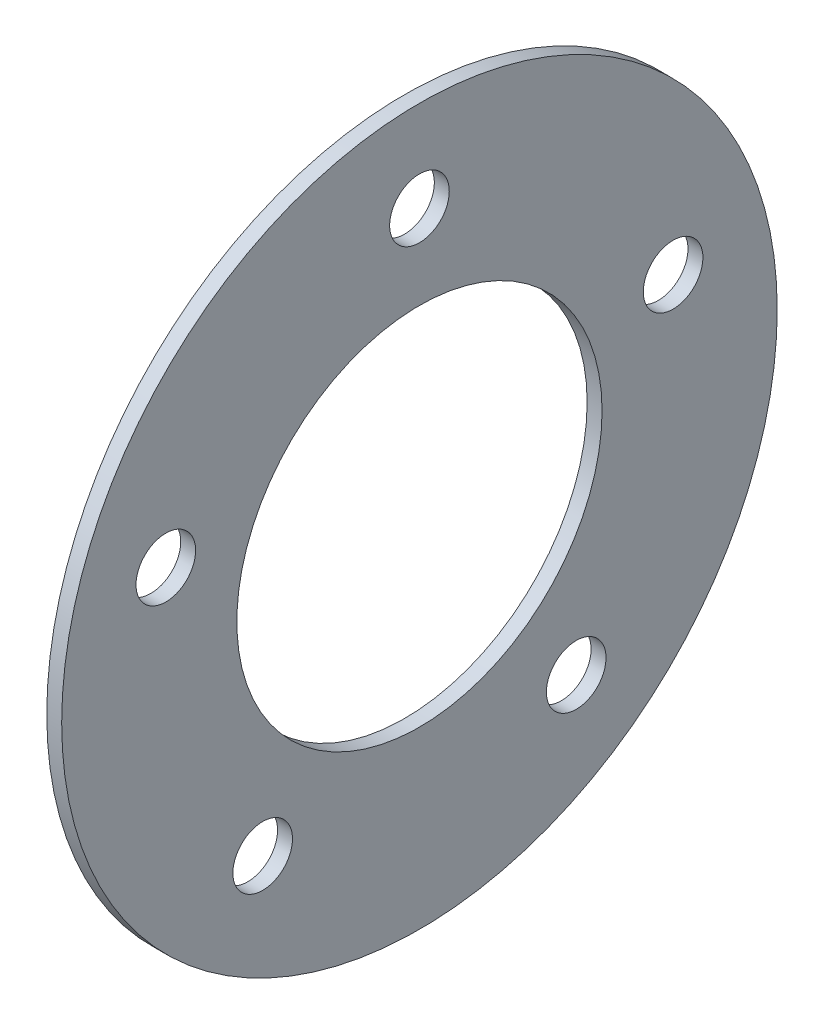
ISO-10303-21;
HEADER;
FILE_DESCRIPTION(('STEP AP214'),'2;1');
FILE_NAME('part.step','',(''),(''),'','','');
FILE_SCHEMA(('AUTOMOTIVE_DESIGN { 1 0 10303 214 1 1 1 1 }'));
ENDSEC;
DATA;
#1=APPLICATION_CONTEXT('core data for automotive mechanical design processes');
#2=APPLICATION_PROTOCOL_DEFINITION('international standard','automotive_design',2000,#1);
#3=PRODUCT_CONTEXT('',#1,'mechanical');
#4=PRODUCT('Part','Part','',(#3));
#5=PRODUCT_RELATED_PRODUCT_CATEGORY('part','',(#4));
#6=PRODUCT_DEFINITION_FORMATION('','',#4);
#7=PRODUCT_DEFINITION_CONTEXT('part definition',#1,'design');
#8=PRODUCT_DEFINITION('design','',#6,#7);
#9=PRODUCT_DEFINITION_SHAPE('','',#8);
#10=(LENGTH_UNIT() NAMED_UNIT(*) SI_UNIT(.MILLI.,.METRE.));
#11=(NAMED_UNIT(*) PLANE_ANGLE_UNIT() SI_UNIT($,.RADIAN.));
#12=(NAMED_UNIT(*) SI_UNIT($,.STERADIAN.) SOLID_ANGLE_UNIT());
#13=UNCERTAINTY_MEASURE_WITH_UNIT(LENGTH_MEASURE(1.E-05),#10,'distance_accuracy_value','');
#14=(GEOMETRIC_REPRESENTATION_CONTEXT(3) GLOBAL_UNCERTAINTY_ASSIGNED_CONTEXT((#13)) GLOBAL_UNIT_ASSIGNED_CONTEXT((#10,
#11,#12)) REPRESENTATION_CONTEXT('',''));
#15=CARTESIAN_POINT('',(0.,0.,0.));
#16=DIRECTION('',(0.,0.,1.));
#17=DIRECTION('',(1.,0.,0.));
#18=AXIS2_PLACEMENT_3D('',#15,#16,#17);
#19=CARTESIAN_POINT('',(1.5875,0.,0.));
#20=DIRECTION('',(1.,0.,0.));
#21=DIRECTION('',(0.,0.,-1.));
#22=AXIS2_PLACEMENT_3D('',#19,#20,#21);
#23=PLANE('',#22);
#24=CARTESIAN_POINT('',(1.5875,17.5520045916606,-54.0195155761761));
#25=DIRECTION('',(1.,0.,0.));
#26=DIRECTION('',(0.,-0.95105651629515,-0.309016994374958));
#27=AXIS2_PLACEMENT_3D('',#24,#25,#26);
#28=CIRCLE('',#27,6.35);
#29=CARTESIAN_POINT('',(1.5875,11.5127957131864,-55.981773490457));
#30=VERTEX_POINT('',#29);
#31=EDGE_CURVE('E88',#30,#30,#28,.T.);
#32=ORIENTED_EDGE('',*,*,#31,.F.);
#33=EDGE_LOOP('',(#32));
#34=FACE_BOUND('',#33,.T.);
#35=CARTESIAN_POINT('',(1.5875,-45.9517445916596,-33.3858966818817));
#36=DIRECTION('',(1.,0.,0.));
#37=DIRECTION('',(0.,-0.58778525229248,0.809016994374942));
#38=AXIS2_PLACEMENT_3D('',#35,#36,#37);
#39=CIRCLE('',#38,6.35);
#40=CARTESIAN_POINT('',(1.5875,-49.6841809437169,-28.2486387676008));
#41=VERTEX_POINT('',#40);
#42=EDGE_CURVE('E82',#41,#41,#39,.T.);
#43=ORIENTED_EDGE('',*,*,#42,.F.);
#44=EDGE_LOOP('',(#43));
#45=FACE_BOUND('',#44,.T.);
#46=CARTESIAN_POINT('',(1.5875,-45.9517445916601,33.385896681881));
#47=DIRECTION('',(1.,0.,0.));
#48=DIRECTION('',(0.,0.587785252292469,0.809016994374951));
#49=AXIS2_PLACEMENT_3D('',#46,#47,#48);
#50=CIRCLE('',#49,6.35);
#51=CARTESIAN_POINT('',(1.5875,-42.219308239603,38.523154596162));
#52=VERTEX_POINT('',#51);
#53=EDGE_CURVE('E75',#52,#52,#50,.T.);
#54=ORIENTED_EDGE('',*,*,#53,.F.);
#55=EDGE_LOOP('',(#54));
#56=FACE_BOUND('',#55,.T.);
#57=CARTESIAN_POINT('',(1.5875,17.5520045916598,54.0195155761763));
#58=DIRECTION('',(1.,0.,0.));
#59=DIRECTION('',(0.,0.951056516295155,-0.309016994374945));
#60=AXIS2_PLACEMENT_3D('',#57,#58,#59);
#61=CIRCLE('',#60,6.35);
#62=CARTESIAN_POINT('',(1.5875,23.591213470134,52.0572576618954));
#63=VERTEX_POINT('',#62);
#64=EDGE_CURVE('E67',#63,#63,#61,.T.);
#65=ORIENTED_EDGE('',*,*,#64,.F.);
#66=EDGE_LOOP('',(#65));
#67=FACE_BOUND('',#66,.T.);
#68=CARTESIAN_POINT('',(1.5875,56.79948,0.));
#69=DIRECTION('',(1.,0.,0.));
#70=DIRECTION('',(0.,0.,-1.));
#71=AXIS2_PLACEMENT_3D('',#68,#69,#70);
#72=CIRCLE('',#71,6.35);
#73=CARTESIAN_POINT('',(1.5875,56.79948,-6.35));
#74=VERTEX_POINT('',#73);
#75=EDGE_CURVE('E60',#74,#74,#72,.T.);
#76=ORIENTED_EDGE('',*,*,#75,.F.);
#77=EDGE_LOOP('',(#76));
#78=FACE_BOUND('',#77,.T.);
#79=CARTESIAN_POINT('',(1.5875,0.,0.));
#80=DIRECTION('',(1.,0.,0.));
#81=DIRECTION('',(0.,0.,-1.));
#82=AXIS2_PLACEMENT_3D('',#79,#80,#81);
#83=CIRCLE('',#82,76.2);
#84=CARTESIAN_POINT('',(1.5875,0.,-76.2));
#85=VERTEX_POINT('',#84);
#86=EDGE_CURVE('E10',#85,#85,#83,.T.);
#87=ORIENTED_EDGE('',*,*,#86,.T.);
#88=EDGE_LOOP('',(#87));
#89=FACE_BOUND('',#88,.T.);
#90=CARTESIAN_POINT('',(1.5875,0.,0.));
#91=DIRECTION('',(1.,0.,0.));
#92=DIRECTION('',(0.,0.,-1.));
#93=AXIS2_PLACEMENT_3D('',#90,#91,#92);
#94=CIRCLE('',#93,38.89375);
#95=CARTESIAN_POINT('',(1.5875,0.,-38.89375));
#96=VERTEX_POINT('',#95);
#97=EDGE_CURVE('E50',#96,#96,#94,.T.);
#98=ORIENTED_EDGE('',*,*,#97,.F.);
#99=EDGE_LOOP('',(#98));
#100=FACE_BOUND('',#99,.T.);
#101=ADVANCED_FACE('F36',(#34,#45,#56,#67,#78,#89,#100),#23,.T.);
#102=CARTESIAN_POINT('',(-1.5875,0.,0.));
#103=DIRECTION('',(1.,0.,0.));
#104=DIRECTION('',(0.,0.,-1.));
#105=AXIS2_PLACEMENT_3D('',#102,#103,#104);
#106=PLANE('',#105);
#107=CARTESIAN_POINT('',(-1.5875,17.5520045916606,-54.0195155761761));
#108=DIRECTION('',(1.,0.,0.));
#109=DIRECTION('',(0.,-0.95105651629515,-0.309016994374958));
#110=AXIS2_PLACEMENT_3D('',#107,#108,#109);
#111=CIRCLE('',#110,6.35);
#112=CARTESIAN_POINT('',(-1.5875,11.5127957131864,-55.981773490457));
#113=VERTEX_POINT('',#112);
#114=EDGE_CURVE('E85',#113,#113,#111,.T.);
#115=ORIENTED_EDGE('',*,*,#114,.T.);
#116=EDGE_LOOP('',(#115));
#117=FACE_BOUND('',#116,.T.);
#118=CARTESIAN_POINT('',(-1.5875,-45.9517445916596,-33.3858966818817));
#119=DIRECTION('',(1.,0.,0.));
#120=DIRECTION('',(0.,-0.58778525229248,0.809016994374942));
#121=AXIS2_PLACEMENT_3D('',#118,#119,#120);
#122=CIRCLE('',#121,6.35);
#123=CARTESIAN_POINT('',(-1.5875,-49.6841809437169,-28.2486387676008));
#124=VERTEX_POINT('',#123);
#125=EDGE_CURVE('E78',#124,#124,#122,.T.);
#126=ORIENTED_EDGE('',*,*,#125,.T.);
#127=EDGE_LOOP('',(#126));
#128=FACE_BOUND('',#127,.T.);
#129=CARTESIAN_POINT('',(-1.5875,-45.9517445916601,33.385896681881));
#130=DIRECTION('',(1.,0.,0.));
#131=DIRECTION('',(0.,0.587785252292469,0.809016994374951));
#132=AXIS2_PLACEMENT_3D('',#129,#130,#131);
#133=CIRCLE('',#132,6.35);
#134=CARTESIAN_POINT('',(-1.5875,-42.219308239603,38.523154596162));
#135=VERTEX_POINT('',#134);
#136=EDGE_CURVE('E71',#135,#135,#133,.T.);
#137=ORIENTED_EDGE('',*,*,#136,.T.);
#138=EDGE_LOOP('',(#137));
#139=FACE_BOUND('',#138,.T.);
#140=CARTESIAN_POINT('',(-1.5875,17.5520045916598,54.0195155761763));
#141=DIRECTION('',(1.,0.,0.));
#142=DIRECTION('',(0.,0.951056516295155,-0.309016994374945));
#143=AXIS2_PLACEMENT_3D('',#140,#141,#142);
#144=CIRCLE('',#143,6.35);
#145=CARTESIAN_POINT('',(-1.5875,23.591213470134,52.0572576618954));
#146=VERTEX_POINT('',#145);
#147=EDGE_CURVE('E63',#146,#146,#144,.T.);
#148=ORIENTED_EDGE('',*,*,#147,.T.);
#149=EDGE_LOOP('',(#148));
#150=FACE_BOUND('',#149,.T.);
#151=CARTESIAN_POINT('',(-1.5875,56.79948,0.));
#152=DIRECTION('',(1.,0.,0.));
#153=DIRECTION('',(0.,0.,-1.));
#154=AXIS2_PLACEMENT_3D('',#151,#152,#153);
#155=CIRCLE('',#154,6.35);
#156=CARTESIAN_POINT('',(-1.5875,56.79948,-6.35));
#157=VERTEX_POINT('',#156);
#158=EDGE_CURVE('E56',#157,#157,#155,.T.);
#159=ORIENTED_EDGE('',*,*,#158,.T.);
#160=EDGE_LOOP('',(#159));
#161=FACE_BOUND('',#160,.T.);
#162=CARTESIAN_POINT('',(-1.5875,0.,0.));
#163=DIRECTION('',(1.,0.,0.));
#164=DIRECTION('',(0.,0.,-1.));
#165=AXIS2_PLACEMENT_3D('',#162,#163,#164);
#166=CIRCLE('',#165,76.2);
#167=CARTESIAN_POINT('',(-1.5875,0.,-76.2));
#168=VERTEX_POINT('',#167);
#169=EDGE_CURVE('E40',#168,#168,#166,.T.);
#170=ORIENTED_EDGE('',*,*,#169,.F.);
#171=EDGE_LOOP('',(#170));
#172=FACE_BOUND('',#171,.T.);
#173=CARTESIAN_POINT('',(-1.5875,0.,0.));
#174=DIRECTION('',(1.,0.,0.));
#175=DIRECTION('',(0.,0.,-1.));
#176=AXIS2_PLACEMENT_3D('',#173,#174,#175);
#177=CIRCLE('',#176,38.89375);
#178=CARTESIAN_POINT('',(-1.5875,0.,-38.89375));
#179=VERTEX_POINT('',#178);
#180=EDGE_CURVE('E52',#179,#179,#177,.T.);
#181=ORIENTED_EDGE('',*,*,#180,.T.);
#182=EDGE_LOOP('',(#181));
#183=FACE_BOUND('',#182,.T.);
#184=ADVANCED_FACE('F94',(#117,#128,#139,#150,#161,#172,#183),#106,.F.);
#185=CARTESIAN_POINT('',(1.5875,0.,0.));
#186=DIRECTION('',(-1.,0.,0.));
#187=DIRECTION('',(0.,0.,1.));
#188=AXIS2_PLACEMENT_3D('',#185,#186,#187);
#189=CYLINDRICAL_SURFACE('',#188,76.2);
#190=ORIENTED_EDGE('',*,*,#86,.F.);
#191=EDGE_LOOP('',(#190));
#192=FACE_BOUND('',#191,.T.);
#193=ORIENTED_EDGE('',*,*,#169,.T.);
#194=EDGE_LOOP('',(#193));
#195=FACE_BOUND('',#194,.T.);
#196=ADVANCED_FACE('F38',(#192,#195),#189,.T.);
#197=CARTESIAN_POINT('',(1.5875,0.,0.));
#198=DIRECTION('',(-1.,0.,0.));
#199=DIRECTION('',(0.,0.,1.));
#200=AXIS2_PLACEMENT_3D('',#197,#198,#199);
#201=CYLINDRICAL_SURFACE('',#200,38.89375);
#202=ORIENTED_EDGE('',*,*,#97,.T.);
#203=EDGE_LOOP('',(#202));
#204=FACE_BOUND('',#203,.T.);
#205=ORIENTED_EDGE('',*,*,#180,.F.);
#206=EDGE_LOOP('',(#205));
#207=FACE_BOUND('',#206,.T.);
#208=ADVANCED_FACE('F117',(#204,#207),#201,.F.);
#209=CARTESIAN_POINT('',(-1.5875,56.79948,0.));
#210=DIRECTION('',(1.,0.,0.));
#211=DIRECTION('',(0.,0.,-1.));
#212=AXIS2_PLACEMENT_3D('',#209,#210,#211);
#213=CYLINDRICAL_SURFACE('',#212,6.35);
#214=ORIENTED_EDGE('',*,*,#158,.F.);
#215=EDGE_LOOP('',(#214));
#216=FACE_BOUND('',#215,.T.);
#217=ORIENTED_EDGE('',*,*,#75,.T.);
#218=EDGE_LOOP('',(#217));
#219=FACE_BOUND('',#218,.T.);
#220=ADVANCED_FACE('F120',(#216,#219),#213,.F.);
#221=CARTESIAN_POINT('',(-1.5875,17.5520045916598,54.0195155761763));
#222=DIRECTION('',(1.,0.,0.));
#223=DIRECTION('',(0.,0.,-1.));
#224=AXIS2_PLACEMENT_3D('',#221,#222,#223);
#225=CYLINDRICAL_SURFACE('',#224,6.35);
#226=ORIENTED_EDGE('',*,*,#147,.F.);
#227=EDGE_LOOP('',(#226));
#228=FACE_BOUND('',#227,.T.);
#229=ORIENTED_EDGE('',*,*,#64,.T.);
#230=EDGE_LOOP('',(#229));
#231=FACE_BOUND('',#230,.T.);
#232=ADVANCED_FACE('F132',(#228,#231),#225,.F.);
#233=CARTESIAN_POINT('',(-1.5875,-45.9517445916601,33.385896681881));
#234=DIRECTION('',(1.,0.,0.));
#235=DIRECTION('',(0.,0.,-1.));
#236=AXIS2_PLACEMENT_3D('',#233,#234,#235);
#237=CYLINDRICAL_SURFACE('',#236,6.35);
#238=ORIENTED_EDGE('',*,*,#136,.F.);
#239=EDGE_LOOP('',(#238));
#240=FACE_BOUND('',#239,.T.);
#241=ORIENTED_EDGE('',*,*,#53,.T.);
#242=EDGE_LOOP('',(#241));
#243=FACE_BOUND('',#242,.T.);
#244=ADVANCED_FACE('F136',(#240,#243),#237,.F.);
#245=CARTESIAN_POINT('',(-1.5875,-45.9517445916596,-33.3858966818817));
#246=DIRECTION('',(1.,0.,0.));
#247=DIRECTION('',(0.,0.,-1.));
#248=AXIS2_PLACEMENT_3D('',#245,#246,#247);
#249=CYLINDRICAL_SURFACE('',#248,6.35);
#250=ORIENTED_EDGE('',*,*,#125,.F.);
#251=EDGE_LOOP('',(#250));
#252=FACE_BOUND('',#251,.T.);
#253=ORIENTED_EDGE('',*,*,#42,.T.);
#254=EDGE_LOOP('',(#253));
#255=FACE_BOUND('',#254,.T.);
#256=ADVANCED_FACE('F100',(#252,#255),#249,.F.);
#257=CARTESIAN_POINT('',(-1.5875,17.5520045916606,-54.0195155761761));
#258=DIRECTION('',(1.,0.,0.));
#259=DIRECTION('',(0.,0.,-1.));
#260=AXIS2_PLACEMENT_3D('',#257,#258,#259);
#261=CYLINDRICAL_SURFACE('',#260,6.35);
#262=ORIENTED_EDGE('',*,*,#114,.F.);
#263=EDGE_LOOP('',(#262));
#264=FACE_BOUND('',#263,.T.);
#265=ORIENTED_EDGE('',*,*,#31,.T.);
#266=EDGE_LOOP('',(#265));
#267=FACE_BOUND('',#266,.T.);
#268=ADVANCED_FACE('F97',(#264,#267),#261,.F.);
#269=CLOSED_SHELL('',(#101,#184,#196,#208,#220,#232,#244,#256,#268));
#270=MANIFOLD_SOLID_BREP('B2',#269);
#271=ADVANCED_BREP_SHAPE_REPRESENTATION('',(#18,#270),#14);
#272=SHAPE_DEFINITION_REPRESENTATION(#9,#271);
ENDSEC;
END-ISO-10303-21;
